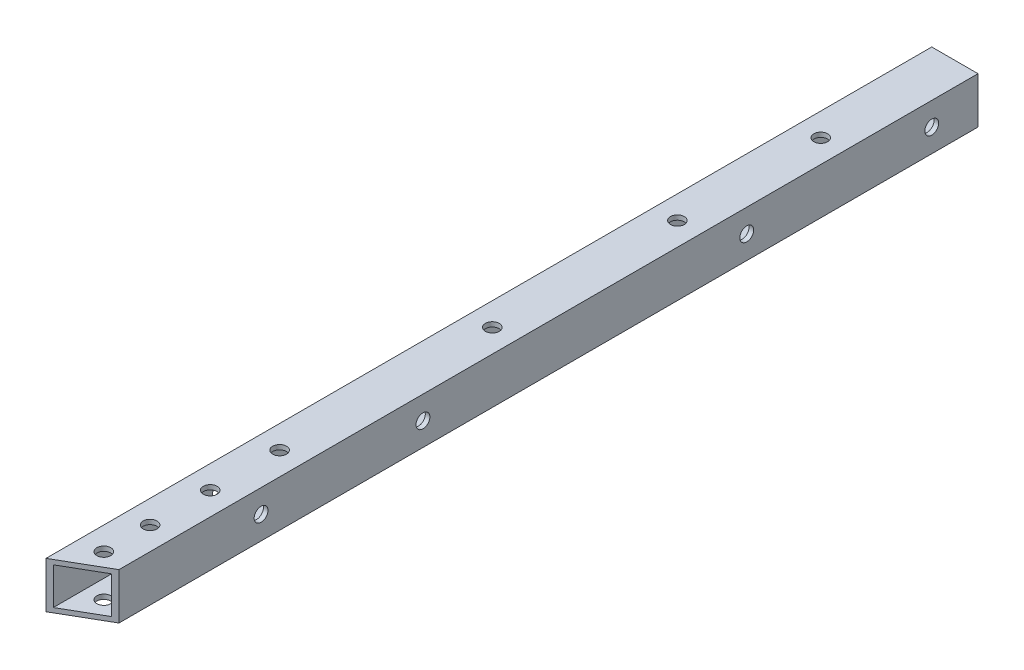
ISO-10303-21;
HEADER;
FILE_DESCRIPTION(('STEP AP214'),'2;1');
FILE_NAME('part.step','',(''),(''),'','','');
FILE_SCHEMA(('AUTOMOTIVE_DESIGN { 1 0 10303 214 1 1 1 1 }'));
ENDSEC;
DATA;
#1=APPLICATION_CONTEXT('core data for automotive mechanical design processes');
#2=APPLICATION_PROTOCOL_DEFINITION('international standard','automotive_design',2000,#1);
#3=PRODUCT_CONTEXT('',#1,'mechanical');
#4=PRODUCT('Part','Part','',(#3));
#5=PRODUCT_RELATED_PRODUCT_CATEGORY('part','',(#4));
#6=PRODUCT_DEFINITION_FORMATION('','',#4);
#7=PRODUCT_DEFINITION_CONTEXT('part definition',#1,'design');
#8=PRODUCT_DEFINITION('design','',#6,#7);
#9=PRODUCT_DEFINITION_SHAPE('','',#8);
#10=(LENGTH_UNIT() NAMED_UNIT(*) SI_UNIT(.MILLI.,.METRE.));
#11=(NAMED_UNIT(*) PLANE_ANGLE_UNIT() SI_UNIT($,.RADIAN.));
#12=(NAMED_UNIT(*) SI_UNIT($,.STERADIAN.) SOLID_ANGLE_UNIT());
#13=UNCERTAINTY_MEASURE_WITH_UNIT(LENGTH_MEASURE(1.E-05),#10,'distance_accuracy_value','');
#14=(GEOMETRIC_REPRESENTATION_CONTEXT(3) GLOBAL_UNCERTAINTY_ASSIGNED_CONTEXT((#13)) GLOBAL_UNIT_ASSIGNED_CONTEXT((#10,
#11,#12)) REPRESENTATION_CONTEXT('',''));
#15=CARTESIAN_POINT('',(0.,0.,0.));
#16=DIRECTION('',(0.,0.,1.));
#17=DIRECTION('',(1.,0.,0.));
#18=AXIS2_PLACEMENT_3D('',#15,#16,#17);
#19=CARTESIAN_POINT('',(0.,0.,0.));
#20=DIRECTION('',(0.,0.,1.));
#21=DIRECTION('',(1.,0.,0.));
#22=AXIS2_PLACEMENT_3D('',#19,#20,#21);
#23=PLANE('',#22);
#24=DIRECTION('',(0.,-1.,0.));
#25=VECTOR('',#24,1.);
#26=CARTESIAN_POINT('',(-5.,-5.,0.));
#27=LINE('',#26,#25);
#28=CARTESIAN_POINT('',(-5.,5.,0.));
#29=VERTEX_POINT('',#28);
#30=CARTESIAN_POINT('',(-5.,-5.,0.));
#31=VERTEX_POINT('',#30);
#32=EDGE_CURVE('E289',#29,#31,#27,.T.);
#33=ORIENTED_EDGE('',*,*,#32,.F.);
#34=DIRECTION('',(-1.,0.,0.));
#35=VECTOR('',#34,1.);
#36=CARTESIAN_POINT('',(-5.,5.,0.));
#37=LINE('',#36,#35);
#38=CARTESIAN_POINT('',(4.99999999999999,5.,0.));
#39=VERTEX_POINT('',#38);
#40=EDGE_CURVE('E291',#39,#29,#37,.T.);
#41=ORIENTED_EDGE('',*,*,#40,.F.);
#42=DIRECTION('',(0.,1.,0.));
#43=VECTOR('',#42,1.);
#44=CARTESIAN_POINT('',(4.99999999999999,-5.,0.));
#45=LINE('',#44,#43);
#46=CARTESIAN_POINT('',(4.99999999999999,-5.,0.));
#47=VERTEX_POINT('',#46);
#48=EDGE_CURVE('E295',#47,#39,#45,.T.);
#49=ORIENTED_EDGE('',*,*,#48,.F.);
#50=DIRECTION('',(1.,0.,0.));
#51=VECTOR('',#50,1.);
#52=CARTESIAN_POINT('',(-5.,-5.,0.));
#53=LINE('',#52,#51);
#54=EDGE_CURVE('E148',#31,#47,#53,.T.);
#55=ORIENTED_EDGE('',*,*,#54,.F.);
#56=EDGE_LOOP('',(#33,#41,#49,#55));
#57=FACE_BOUND('',#56,.T.);
#58=DIRECTION('',(0.,-1.,0.));
#59=VECTOR('',#58,1.);
#60=CARTESIAN_POINT('',(-4.,0.,0.));
#61=LINE('',#60,#59);
#62=CARTESIAN_POINT('',(-4.,4.,0.));
#63=VERTEX_POINT('',#62);
#64=CARTESIAN_POINT('',(-4.,-4.,0.));
#65=VERTEX_POINT('',#64);
#66=EDGE_CURVE('E269',#63,#65,#61,.T.);
#67=ORIENTED_EDGE('',*,*,#66,.T.);
#68=DIRECTION('',(1.,0.,0.));
#69=VECTOR('',#68,1.);
#70=CARTESIAN_POINT('',(0.,-4.,0.));
#71=LINE('',#70,#69);
#72=CARTESIAN_POINT('',(3.99999999999999,-4.,0.));
#73=VERTEX_POINT('',#72);
#74=EDGE_CURVE('E272',#65,#73,#71,.T.);
#75=ORIENTED_EDGE('',*,*,#74,.T.);
#76=DIRECTION('',(0.,1.,0.));
#77=VECTOR('',#76,1.);
#78=CARTESIAN_POINT('',(3.99999999999999,0.,0.));
#79=LINE('',#78,#77);
#80=CARTESIAN_POINT('',(3.99999999999999,4.,0.));
#81=VERTEX_POINT('',#80);
#82=EDGE_CURVE('E275',#73,#81,#79,.T.);
#83=ORIENTED_EDGE('',*,*,#82,.T.);
#84=DIRECTION('',(-1.,0.,0.));
#85=VECTOR('',#84,1.);
#86=CARTESIAN_POINT('',(0.,4.,0.));
#87=LINE('',#86,#85);
#88=EDGE_CURVE('E278',#81,#63,#87,.T.);
#89=ORIENTED_EDGE('',*,*,#88,.T.);
#90=EDGE_LOOP('',(#67,#75,#83,#89));
#91=FACE_BOUND('',#90,.T.);
#92=ADVANCED_FACE('F63',(#57,#91),#23,.F.);
#93=CARTESIAN_POINT('',(-5.,-5.,191.5));
#94=DIRECTION('',(1.,0.,0.));
#95=DIRECTION('',(0.,0.,-1.));
#96=AXIS2_PLACEMENT_3D('',#93,#94,#95);
#97=PLANE('',#96);
#98=CARTESIAN_POINT('',(-5.,0.,155.));
#99=DIRECTION('',(-1.,0.,0.));
#100=DIRECTION('',(0.,0.,1.));
#101=AXIS2_PLACEMENT_3D('',#98,#99,#100);
#102=CIRCLE('',#101,1.5);
#103=CARTESIAN_POINT('',(-5.,0.,156.5));
#104=VERTEX_POINT('',#103);
#105=EDGE_CURVE('E409',#104,#104,#102,.T.);
#106=ORIENTED_EDGE('',*,*,#105,.F.);
#107=EDGE_LOOP('',(#106));
#108=FACE_BOUND('',#107,.T.);
#109=CARTESIAN_POINT('',(-5.,0.,50.));
#110=DIRECTION('',(-1.,0.,0.));
#111=DIRECTION('',(0.,0.,1.));
#112=AXIS2_PLACEMENT_3D('',#109,#110,#111);
#113=CIRCLE('',#112,1.5);
#114=CARTESIAN_POINT('',(-5.,0.,51.5));
#115=VERTEX_POINT('',#114);
#116=EDGE_CURVE('E410',#115,#115,#113,.T.);
#117=ORIENTED_EDGE('',*,*,#116,.F.);
#118=EDGE_LOOP('',(#117));
#119=FACE_BOUND('',#118,.T.);
#120=CARTESIAN_POINT('',(-5.,0.,120.));
#121=DIRECTION('',(-1.,0.,0.));
#122=DIRECTION('',(0.,0.,1.));
#123=AXIS2_PLACEMENT_3D('',#120,#121,#122);
#124=CIRCLE('',#123,1.5);
#125=CARTESIAN_POINT('',(-5.,0.,121.5));
#126=VERTEX_POINT('',#125);
#127=EDGE_CURVE('E420',#126,#126,#124,.T.);
#128=ORIENTED_EDGE('',*,*,#127,.F.);
#129=EDGE_LOOP('',(#128));
#130=FACE_BOUND('',#129,.T.);
#131=CARTESIAN_POINT('',(-5.,0.,10.));
#132=DIRECTION('',(-1.,0.,0.));
#133=DIRECTION('',(0.,0.,1.));
#134=AXIS2_PLACEMENT_3D('',#131,#132,#133);
#135=CIRCLE('',#134,1.5);
#136=CARTESIAN_POINT('',(-5.,0.,11.5));
#137=VERTEX_POINT('',#136);
#138=EDGE_CURVE('E426',#137,#137,#135,.T.);
#139=ORIENTED_EDGE('',*,*,#138,.F.);
#140=EDGE_LOOP('',(#139));
#141=FACE_BOUND('',#140,.T.);
#142=ORIENTED_EDGE('',*,*,#32,.T.);
#143=DIRECTION('',(0.,0.,-1.));
#144=VECTOR('',#143,1.);
#145=CARTESIAN_POINT('',(-5.,-5.,191.5));
#146=LINE('',#145,#144);
#147=CARTESIAN_POINT('',(-5.,-5.,191.5));
#148=VERTEX_POINT('',#147);
#149=EDGE_CURVE('E72',#148,#31,#146,.T.);
#150=ORIENTED_EDGE('',*,*,#149,.F.);
#151=DIRECTION('',(0.,-1.,0.));
#152=VECTOR('',#151,1.);
#153=CARTESIAN_POINT('',(-5.,-5.,191.5));
#154=LINE('',#153,#152);
#155=CARTESIAN_POINT('',(-5.,5.,191.5));
#156=VERTEX_POINT('',#155);
#157=EDGE_CURVE('E130',#156,#148,#154,.T.);
#158=ORIENTED_EDGE('',*,*,#157,.F.);
#159=DIRECTION('',(0.,0.,-1.));
#160=VECTOR('',#159,1.);
#161=CARTESIAN_POINT('',(-5.,5.,191.5));
#162=LINE('',#161,#160);
#163=EDGE_CURVE('E152',#156,#29,#162,.T.);
#164=ORIENTED_EDGE('',*,*,#163,.T.);
#165=EDGE_LOOP('',(#142,#150,#158,#164));
#166=FACE_BOUND('',#165,.T.);
#167=ADVANCED_FACE('F65',(#108,#119,#130,#141,#166),#97,.F.);
#168=CARTESIAN_POINT('',(-5.,-5.,191.5));
#169=DIRECTION('',(0.,1.,0.));
#170=DIRECTION('',(0.,0.,1.));
#171=AXIS2_PLACEMENT_3D('',#168,#169,#170);
#172=PLANE('',#171);
#173=CARTESIAN_POINT('',(0.,-5.,60.));
#174=DIRECTION('',(0.,-1.,0.));
#175=DIRECTION('',(0.,0.,-1.));
#176=AXIS2_PLACEMENT_3D('',#173,#174,#175);
#177=CIRCLE('',#176,1.5);
#178=CARTESIAN_POINT('',(0.,-5.,58.5));
#179=VERTEX_POINT('',#178);
#180=EDGE_CURVE('E234',#179,#179,#177,.T.);
#181=ORIENTED_EDGE('',*,*,#180,.F.);
#182=EDGE_LOOP('',(#181));
#183=FACE_BOUND('',#182,.T.);
#184=CARTESIAN_POINT('',(0.,-5.,100.));
#185=DIRECTION('',(0.,-1.,0.));
#186=DIRECTION('',(0.,0.,-1.));
#187=AXIS2_PLACEMENT_3D('',#184,#185,#186);
#188=CIRCLE('',#187,1.5);
#189=CARTESIAN_POINT('',(0.,-5.,98.5));
#190=VERTEX_POINT('',#189);
#191=EDGE_CURVE('E145',#190,#190,#188,.T.);
#192=ORIENTED_EDGE('',*,*,#191,.F.);
#193=EDGE_LOOP('',(#192));
#194=FACE_BOUND('',#193,.T.);
#195=CARTESIAN_POINT('',(0.,-5.,29.));
#196=DIRECTION('',(0.,-1.,0.));
#197=DIRECTION('',(0.,0.,-1.));
#198=AXIS2_PLACEMENT_3D('',#195,#196,#197);
#199=CIRCLE('',#198,1.5);
#200=CARTESIAN_POINT('',(0.,-5.,27.5));
#201=VERTEX_POINT('',#200);
#202=EDGE_CURVE('E239',#201,#201,#199,.T.);
#203=ORIENTED_EDGE('',*,*,#202,.F.);
#204=EDGE_LOOP('',(#203));
#205=FACE_BOUND('',#204,.T.);
#206=CARTESIAN_POINT('',(0.,-5.,161.));
#207=DIRECTION('',(0.,-1.,0.));
#208=DIRECTION('',(0.,0.,-1.));
#209=AXIS2_PLACEMENT_3D('',#206,#207,#208);
#210=CIRCLE('',#209,1.5);
#211=CARTESIAN_POINT('',(0.,-5.,159.5));
#212=VERTEX_POINT('',#211);
#213=EDGE_CURVE('E211',#212,#212,#210,.T.);
#214=ORIENTED_EDGE('',*,*,#213,.F.);
#215=EDGE_LOOP('',(#214));
#216=FACE_BOUND('',#215,.T.);
#217=CARTESIAN_POINT('',(0.,-5.,146.));
#218=DIRECTION('',(0.,-1.,0.));
#219=DIRECTION('',(0.,0.,-1.));
#220=AXIS2_PLACEMENT_3D('',#217,#218,#219);
#221=CIRCLE('',#220,1.5);
#222=CARTESIAN_POINT('',(0.,-5.,144.5));
#223=VERTEX_POINT('',#222);
#224=EDGE_CURVE('E224',#223,#223,#221,.T.);
#225=ORIENTED_EDGE('',*,*,#224,.F.);
#226=EDGE_LOOP('',(#225));
#227=FACE_BOUND('',#226,.T.);
#228=CARTESIAN_POINT('',(0.,-5.,173.994446500535));
#229=DIRECTION('',(0.,-1.,0.));
#230=DIRECTION('',(0.,0.,-1.));
#231=AXIS2_PLACEMENT_3D('',#228,#229,#230);
#232=CIRCLE('',#231,1.5);
#233=CARTESIAN_POINT('',(0.,-5.,172.494446500535));
#234=VERTEX_POINT('',#233);
#235=EDGE_CURVE('E217',#234,#234,#232,.T.);
#236=ORIENTED_EDGE('',*,*,#235,.F.);
#237=EDGE_LOOP('',(#236));
#238=FACE_BOUND('',#237,.T.);
#239=CARTESIAN_POINT('',(0.,-5.,183.994446500535));
#240=DIRECTION('',(0.,-1.,0.));
#241=DIRECTION('',(0.,0.,-1.));
#242=AXIS2_PLACEMENT_3D('',#239,#240,#241);
#243=CIRCLE('',#242,1.5);
#244=CARTESIAN_POINT('',(0.,-5.,182.494446500535));
#245=VERTEX_POINT('',#244);
#246=EDGE_CURVE('E242',#245,#245,#243,.T.);
#247=ORIENTED_EDGE('',*,*,#246,.F.);
#248=EDGE_LOOP('',(#247));
#249=FACE_BOUND('',#248,.T.);
#250=DIRECTION('',(0.,0.,-1.));
#251=VECTOR('',#250,1.);
#252=CARTESIAN_POINT('',(4.99999999999999,-5.,191.5));
#253=LINE('',#252,#251);
#254=CARTESIAN_POINT('',(4.99999999999999,-5.,185.726497308104));
#255=VERTEX_POINT('',#254);
#256=EDGE_CURVE('E142',#255,#47,#253,.T.);
#257=ORIENTED_EDGE('',*,*,#256,.F.);
#258=DIRECTION('',(0.866025403784442,0.,-0.499999999999994));
#259=VECTOR('',#258,1.);
#260=CARTESIAN_POINT('',(-5.,-5.,191.5));
#261=LINE('',#260,#259);
#262=EDGE_CURVE('E127',#148,#255,#261,.T.);
#263=ORIENTED_EDGE('',*,*,#262,.F.);
#264=ORIENTED_EDGE('',*,*,#149,.T.);
#265=ORIENTED_EDGE('',*,*,#54,.T.);
#266=EDGE_LOOP('',(#257,#263,#264,#265));
#267=FACE_BOUND('',#266,.T.);
#268=ADVANCED_FACE('F147',(#183,#194,#205,#216,#227,#238,#249,#267),#172,.F.);
#269=CARTESIAN_POINT('',(4.99999999999999,-5.,191.5));
#270=DIRECTION('',(-1.,0.,0.));
#271=DIRECTION('',(0.,0.,1.));
#272=AXIS2_PLACEMENT_3D('',#269,#270,#271);
#273=PLANE('',#272);
#274=CARTESIAN_POINT('',(4.99999999999999,0.,155.));
#275=DIRECTION('',(-1.,0.,0.));
#276=DIRECTION('',(0.,0.,1.));
#277=AXIS2_PLACEMENT_3D('',#274,#275,#276);
#278=CIRCLE('',#277,1.5);
#279=CARTESIAN_POINT('',(4.99999999999999,0.,156.5));
#280=VERTEX_POINT('',#279);
#281=EDGE_CURVE('E189',#280,#280,#278,.T.);
#282=ORIENTED_EDGE('',*,*,#281,.T.);
#283=EDGE_LOOP('',(#282));
#284=FACE_BOUND('',#283,.T.);
#285=CARTESIAN_POINT('',(4.99999999999999,0.,50.));
#286=DIRECTION('',(-1.,0.,0.));
#287=DIRECTION('',(0.,0.,1.));
#288=AXIS2_PLACEMENT_3D('',#285,#286,#287);
#289=CIRCLE('',#288,1.5);
#290=CARTESIAN_POINT('',(4.99999999999999,0.,51.5));
#291=VERTEX_POINT('',#290);
#292=EDGE_CURVE('E415',#291,#291,#289,.T.);
#293=ORIENTED_EDGE('',*,*,#292,.T.);
#294=EDGE_LOOP('',(#293));
#295=FACE_BOUND('',#294,.T.);
#296=CARTESIAN_POINT('',(4.99999999999999,0.,120.));
#297=DIRECTION('',(-1.,0.,0.));
#298=DIRECTION('',(0.,0.,1.));
#299=AXIS2_PLACEMENT_3D('',#296,#297,#298);
#300=CIRCLE('',#299,1.5);
#301=CARTESIAN_POINT('',(4.99999999999999,0.,121.5));
#302=VERTEX_POINT('',#301);
#303=EDGE_CURVE('E423',#302,#302,#300,.T.);
#304=ORIENTED_EDGE('',*,*,#303,.T.);
#305=EDGE_LOOP('',(#304));
#306=FACE_BOUND('',#305,.T.);
#307=CARTESIAN_POINT('',(4.99999999999999,0.,10.));
#308=DIRECTION('',(-1.,0.,0.));
#309=DIRECTION('',(0.,0.,1.));
#310=AXIS2_PLACEMENT_3D('',#307,#308,#309);
#311=CIRCLE('',#310,1.5);
#312=CARTESIAN_POINT('',(4.99999999999999,0.,11.5));
#313=VERTEX_POINT('',#312);
#314=EDGE_CURVE('E428',#313,#313,#311,.T.);
#315=ORIENTED_EDGE('',*,*,#314,.T.);
#316=EDGE_LOOP('',(#315));
#317=FACE_BOUND('',#316,.T.);
#318=DIRECTION('',(0.,0.,-1.));
#319=VECTOR('',#318,1.);
#320=CARTESIAN_POINT('',(4.99999999999999,5.,191.5));
#321=LINE('',#320,#319);
#322=CARTESIAN_POINT('',(4.99999999999999,5.,185.726497308104));
#323=VERTEX_POINT('',#322);
#324=EDGE_CURVE('E144',#323,#39,#321,.T.);
#325=ORIENTED_EDGE('',*,*,#324,.F.);
#326=DIRECTION('',(0.,-1.,0.));
#327=VECTOR('',#326,1.);
#328=CARTESIAN_POINT('',(4.99999999999999,5.,185.726497308104));
#329=LINE('',#328,#327);
#330=EDGE_CURVE('E80',#323,#255,#329,.T.);
#331=ORIENTED_EDGE('',*,*,#330,.T.);
#332=ORIENTED_EDGE('',*,*,#256,.T.);
#333=ORIENTED_EDGE('',*,*,#48,.T.);
#334=EDGE_LOOP('',(#325,#331,#332,#333));
#335=FACE_BOUND('',#334,.T.);
#336=ADVANCED_FACE('F140',(#284,#295,#306,#317,#335),#273,.F.);
#337=CARTESIAN_POINT('',(-5.,5.,191.5));
#338=DIRECTION('',(0.,-1.,0.));
#339=DIRECTION('',(0.,0.,-1.));
#340=AXIS2_PLACEMENT_3D('',#337,#338,#339);
#341=PLANE('',#340);
#342=CARTESIAN_POINT('',(0.,5.,60.));
#343=DIRECTION('',(0.,-1.,0.));
#344=DIRECTION('',(0.,0.,-1.));
#345=AXIS2_PLACEMENT_3D('',#342,#343,#344);
#346=CIRCLE('',#345,1.5);
#347=CARTESIAN_POINT('',(0.,5.,58.5));
#348=VERTEX_POINT('',#347);
#349=EDGE_CURVE('E220',#348,#348,#346,.T.);
#350=ORIENTED_EDGE('',*,*,#349,.T.);
#351=EDGE_LOOP('',(#350));
#352=FACE_BOUND('',#351,.T.);
#353=CARTESIAN_POINT('',(0.,5.,100.));
#354=DIRECTION('',(0.,-1.,0.));
#355=DIRECTION('',(0.,0.,-1.));
#356=AXIS2_PLACEMENT_3D('',#353,#354,#355);
#357=CIRCLE('',#356,1.5);
#358=CARTESIAN_POINT('',(0.,5.,98.5));
#359=VERTEX_POINT('',#358);
#360=EDGE_CURVE('E231',#359,#359,#357,.T.);
#361=ORIENTED_EDGE('',*,*,#360,.T.);
#362=EDGE_LOOP('',(#361));
#363=FACE_BOUND('',#362,.T.);
#364=CARTESIAN_POINT('',(0.,5.,29.));
#365=DIRECTION('',(0.,-1.,0.));
#366=DIRECTION('',(0.,0.,-1.));
#367=AXIS2_PLACEMENT_3D('',#364,#365,#366);
#368=CIRCLE('',#367,1.5);
#369=CARTESIAN_POINT('',(0.,5.,27.5));
#370=VERTEX_POINT('',#369);
#371=EDGE_CURVE('E135',#370,#370,#368,.T.);
#372=ORIENTED_EDGE('',*,*,#371,.T.);
#373=EDGE_LOOP('',(#372));
#374=FACE_BOUND('',#373,.T.);
#375=CARTESIAN_POINT('',(0.,5.,161.));
#376=DIRECTION('',(0.,-1.,0.));
#377=DIRECTION('',(0.,0.,-1.));
#378=AXIS2_PLACEMENT_3D('',#375,#376,#377);
#379=CIRCLE('',#378,1.5);
#380=CARTESIAN_POINT('',(0.,5.,159.5));
#381=VERTEX_POINT('',#380);
#382=EDGE_CURVE('E210',#381,#381,#379,.T.);
#383=ORIENTED_EDGE('',*,*,#382,.T.);
#384=EDGE_LOOP('',(#383));
#385=FACE_BOUND('',#384,.T.);
#386=CARTESIAN_POINT('',(0.,5.,146.));
#387=DIRECTION('',(0.,-1.,0.));
#388=DIRECTION('',(0.,0.,-1.));
#389=AXIS2_PLACEMENT_3D('',#386,#387,#388);
#390=CIRCLE('',#389,1.5);
#391=CARTESIAN_POINT('',(0.,5.,144.5));
#392=VERTEX_POINT('',#391);
#393=EDGE_CURVE('E214',#392,#392,#390,.T.);
#394=ORIENTED_EDGE('',*,*,#393,.T.);
#395=EDGE_LOOP('',(#394));
#396=FACE_BOUND('',#395,.T.);
#397=CARTESIAN_POINT('',(0.,5.,173.994446500535));
#398=DIRECTION('',(0.,-1.,0.));
#399=DIRECTION('',(0.,0.,-1.));
#400=AXIS2_PLACEMENT_3D('',#397,#398,#399);
#401=CIRCLE('',#400,1.5);
#402=CARTESIAN_POINT('',(0.,5.,172.494446500535));
#403=VERTEX_POINT('',#402);
#404=EDGE_CURVE('E221',#403,#403,#401,.T.);
#405=ORIENTED_EDGE('',*,*,#404,.T.);
#406=EDGE_LOOP('',(#405));
#407=FACE_BOUND('',#406,.T.);
#408=CARTESIAN_POINT('',(0.,5.,183.994446500535));
#409=DIRECTION('',(0.,-1.,0.));
#410=DIRECTION('',(0.,0.,-1.));
#411=AXIS2_PLACEMENT_3D('',#408,#409,#410);
#412=CIRCLE('',#411,1.5);
#413=CARTESIAN_POINT('',(0.,5.,182.494446500535));
#414=VERTEX_POINT('',#413);
#415=EDGE_CURVE('E160',#414,#414,#412,.T.);
#416=ORIENTED_EDGE('',*,*,#415,.T.);
#417=EDGE_LOOP('',(#416));
#418=FACE_BOUND('',#417,.T.);
#419=ORIENTED_EDGE('',*,*,#163,.F.);
#420=DIRECTION('',(0.866025403784442,0.,-0.499999999999994));
#421=VECTOR('',#420,1.);
#422=CARTESIAN_POINT('',(-5.,5.,191.5));
#423=LINE('',#422,#421);
#424=EDGE_CURVE('E136',#156,#323,#423,.T.);
#425=ORIENTED_EDGE('',*,*,#424,.T.);
#426=ORIENTED_EDGE('',*,*,#324,.T.);
#427=ORIENTED_EDGE('',*,*,#40,.T.);
#428=EDGE_LOOP('',(#419,#425,#426,#427));
#429=FACE_BOUND('',#428,.T.);
#430=ADVANCED_FACE('F305',(#352,#363,#374,#385,#396,#407,#418,#429),#341,.F.);
#431=CARTESIAN_POINT('',(-4.,0.,191.5));
#432=DIRECTION('',(1.,0.,0.));
#433=DIRECTION('',(0.,0.,-1.));
#434=AXIS2_PLACEMENT_3D('',#431,#432,#433);
#435=PLANE('',#434);
#436=CARTESIAN_POINT('',(-4.,0.,155.));
#437=DIRECTION('',(1.,0.,0.));
#438=DIRECTION('',(0.,0.,-1.));
#439=AXIS2_PLACEMENT_3D('',#436,#437,#438);
#440=CIRCLE('',#439,1.5);
#441=CARTESIAN_POINT('',(-4.,0.,153.5));
#442=VERTEX_POINT('',#441);
#443=EDGE_CURVE('E207',#442,#442,#440,.T.);
#444=ORIENTED_EDGE('',*,*,#443,.F.);
#445=EDGE_LOOP('',(#444));
#446=FACE_BOUND('',#445,.T.);
#447=CARTESIAN_POINT('',(-4.,0.,50.));
#448=DIRECTION('',(1.,0.,0.));
#449=DIRECTION('',(0.,0.,-1.));
#450=AXIS2_PLACEMENT_3D('',#447,#448,#449);
#451=CIRCLE('',#450,1.5);
#452=CARTESIAN_POINT('',(-4.,0.,48.5));
#453=VERTEX_POINT('',#452);
#454=EDGE_CURVE('E195',#453,#453,#451,.T.);
#455=ORIENTED_EDGE('',*,*,#454,.F.);
#456=EDGE_LOOP('',(#455));
#457=FACE_BOUND('',#456,.T.);
#458=CARTESIAN_POINT('',(-4.,0.,120.));
#459=DIRECTION('',(1.,0.,0.));
#460=DIRECTION('',(0.,0.,-1.));
#461=AXIS2_PLACEMENT_3D('',#458,#459,#460);
#462=CIRCLE('',#461,1.5);
#463=CARTESIAN_POINT('',(-4.,0.,118.5));
#464=VERTEX_POINT('',#463);
#465=EDGE_CURVE('E192',#464,#464,#462,.T.);
#466=ORIENTED_EDGE('',*,*,#465,.F.);
#467=EDGE_LOOP('',(#466));
#468=FACE_BOUND('',#467,.T.);
#469=CARTESIAN_POINT('',(-4.,0.,10.));
#470=DIRECTION('',(1.,0.,0.));
#471=DIRECTION('',(0.,0.,-1.));
#472=AXIS2_PLACEMENT_3D('',#469,#470,#471);
#473=CIRCLE('',#472,1.5);
#474=CARTESIAN_POINT('',(-4.,0.,8.5));
#475=VERTEX_POINT('',#474);
#476=EDGE_CURVE('E188',#475,#475,#473,.T.);
#477=ORIENTED_EDGE('',*,*,#476,.F.);
#478=EDGE_LOOP('',(#477));
#479=FACE_BOUND('',#478,.T.);
#480=DIRECTION('',(0.,1.,0.));
#481=VECTOR('',#480,1.);
#482=CARTESIAN_POINT('',(-4.,0.,190.92264973081));
#483=LINE('',#482,#481);
#484=CARTESIAN_POINT('',(-4.,-4.,190.92264973081));
#485=VERTEX_POINT('',#484);
#486=CARTESIAN_POINT('',(-4.,4.,190.92264973081));
#487=VERTEX_POINT('',#486);
#488=EDGE_CURVE('E87',#485,#487,#483,.T.);
#489=ORIENTED_EDGE('',*,*,#488,.F.);
#490=DIRECTION('',(0.,0.,-1.));
#491=VECTOR('',#490,1.);
#492=CARTESIAN_POINT('',(-4.,-4.,191.5));
#493=LINE('',#492,#491);
#494=EDGE_CURVE('E287',#485,#65,#493,.T.);
#495=ORIENTED_EDGE('',*,*,#494,.T.);
#496=ORIENTED_EDGE('',*,*,#66,.F.);
#497=DIRECTION('',(0.,0.,-1.));
#498=VECTOR('',#497,1.);
#499=CARTESIAN_POINT('',(-4.,4.,191.5));
#500=LINE('',#499,#498);
#501=EDGE_CURVE('E281',#487,#63,#500,.T.);
#502=ORIENTED_EDGE('',*,*,#501,.F.);
#503=EDGE_LOOP('',(#489,#495,#496,#502));
#504=FACE_BOUND('',#503,.T.);
#505=ADVANCED_FACE('F307',(#446,#457,#468,#479,#504),#435,.T.);
#506=CARTESIAN_POINT('',(0.,-4.,191.5));
#507=DIRECTION('',(0.,1.,0.));
#508=DIRECTION('',(0.,0.,1.));
#509=AXIS2_PLACEMENT_3D('',#506,#507,#508);
#510=PLANE('',#509);
#511=CARTESIAN_POINT('',(0.,-4.,60.));
#512=DIRECTION('',(0.,1.,0.));
#513=DIRECTION('',(0.,0.,1.));
#514=AXIS2_PLACEMENT_3D('',#511,#512,#513);
#515=CIRCLE('',#514,1.5);
#516=CARTESIAN_POINT('',(0.,-4.,61.5));
#517=VERTEX_POINT('',#516);
#518=EDGE_CURVE('E184',#517,#517,#515,.T.);
#519=ORIENTED_EDGE('',*,*,#518,.F.);
#520=EDGE_LOOP('',(#519));
#521=FACE_BOUND('',#520,.T.);
#522=CARTESIAN_POINT('',(0.,-4.,100.));
#523=DIRECTION('',(0.,1.,0.));
#524=DIRECTION('',(0.,0.,1.));
#525=AXIS2_PLACEMENT_3D('',#522,#523,#524);
#526=CIRCLE('',#525,1.5);
#527=CARTESIAN_POINT('',(0.,-4.,101.5));
#528=VERTEX_POINT('',#527);
#529=EDGE_CURVE('E180',#528,#528,#526,.T.);
#530=ORIENTED_EDGE('',*,*,#529,.F.);
#531=EDGE_LOOP('',(#530));
#532=FACE_BOUND('',#531,.T.);
#533=DIRECTION('',(-0.866025403784442,0.,0.499999999999994));
#534=VECTOR('',#533,1.);
#535=CARTESIAN_POINT('',(-1.24999999999997,-4.,189.334936490539));
#536=LINE('',#535,#534);
#537=CARTESIAN_POINT('',(3.99999999999999,-4.,186.303847577293));
#538=VERTEX_POINT('',#537);
#539=EDGE_CURVE('E262',#538,#485,#536,.T.);
#540=ORIENTED_EDGE('',*,*,#539,.F.);
#541=DIRECTION('',(0.,0.,-1.));
#542=VECTOR('',#541,1.);
#543=CARTESIAN_POINT('',(3.99999999999999,-4.,191.5));
#544=LINE('',#543,#542);
#545=EDGE_CURVE('E285',#538,#73,#544,.T.);
#546=ORIENTED_EDGE('',*,*,#545,.T.);
#547=ORIENTED_EDGE('',*,*,#74,.F.);
#548=ORIENTED_EDGE('',*,*,#494,.F.);
#549=EDGE_LOOP('',(#540,#546,#547,#548));
#550=FACE_BOUND('',#549,.T.);
#551=CARTESIAN_POINT('',(0.,-4.,29.));
#552=DIRECTION('',(0.,1.,0.));
#553=DIRECTION('',(0.,0.,1.));
#554=AXIS2_PLACEMENT_3D('',#551,#552,#553);
#555=CIRCLE('',#554,1.5);
#556=CARTESIAN_POINT('',(0.,-4.,30.5));
#557=VERTEX_POINT('',#556);
#558=EDGE_CURVE('E175',#557,#557,#555,.T.);
#559=ORIENTED_EDGE('',*,*,#558,.F.);
#560=EDGE_LOOP('',(#559));
#561=FACE_BOUND('',#560,.T.);
#562=CARTESIAN_POINT('',(0.,-4.,161.));
#563=DIRECTION('',(0.,1.,0.));
#564=DIRECTION('',(0.,0.,1.));
#565=AXIS2_PLACEMENT_3D('',#562,#563,#564);
#566=CIRCLE('',#565,1.5);
#567=CARTESIAN_POINT('',(0.,-4.,162.5));
#568=VERTEX_POINT('',#567);
#569=EDGE_CURVE('E172',#568,#568,#566,.T.);
#570=ORIENTED_EDGE('',*,*,#569,.F.);
#571=EDGE_LOOP('',(#570));
#572=FACE_BOUND('',#571,.T.);
#573=CARTESIAN_POINT('',(0.,-4.,146.));
#574=DIRECTION('',(0.,1.,0.));
#575=DIRECTION('',(0.,0.,1.));
#576=AXIS2_PLACEMENT_3D('',#573,#574,#575);
#577=CIRCLE('',#576,1.5);
#578=CARTESIAN_POINT('',(0.,-4.,147.5));
#579=VERTEX_POINT('',#578);
#580=EDGE_CURVE('E168',#579,#579,#577,.T.);
#581=ORIENTED_EDGE('',*,*,#580,.F.);
#582=EDGE_LOOP('',(#581));
#583=FACE_BOUND('',#582,.T.);
#584=CARTESIAN_POINT('',(0.,-4.,173.994446500535));
#585=DIRECTION('',(0.,1.,0.));
#586=DIRECTION('',(0.,0.,1.));
#587=AXIS2_PLACEMENT_3D('',#584,#585,#586);
#588=CIRCLE('',#587,1.5);
#589=CARTESIAN_POINT('',(0.,-4.,175.494446500535));
#590=VERTEX_POINT('',#589);
#591=EDGE_CURVE('E164',#590,#590,#588,.T.);
#592=ORIENTED_EDGE('',*,*,#591,.F.);
#593=EDGE_LOOP('',(#592));
#594=FACE_BOUND('',#593,.T.);
#595=CARTESIAN_POINT('',(0.,-4.,183.994446500535));
#596=DIRECTION('',(0.,1.,0.));
#597=DIRECTION('',(0.,0.,1.));
#598=AXIS2_PLACEMENT_3D('',#595,#596,#597);
#599=CIRCLE('',#598,1.5);
#600=CARTESIAN_POINT('',(0.,-4.,185.494446500535));
#601=VERTEX_POINT('',#600);
#602=EDGE_CURVE('E159',#601,#601,#599,.T.);
#603=ORIENTED_EDGE('',*,*,#602,.F.);
#604=EDGE_LOOP('',(#603));
#605=FACE_BOUND('',#604,.T.);
#606=ADVANCED_FACE('F314',(#521,#532,#550,#561,#572,#583,#594,#605),#510,.T.);
#607=CARTESIAN_POINT('',(3.99999999999999,0.,191.5));
#608=DIRECTION('',(-1.,0.,0.));
#609=DIRECTION('',(0.,0.,1.));
#610=AXIS2_PLACEMENT_3D('',#607,#608,#609);
#611=PLANE('',#610);
#612=CARTESIAN_POINT('',(3.99999999999999,0.,155.));
#613=DIRECTION('',(-1.,0.,0.));
#614=DIRECTION('',(0.,0.,1.));
#615=AXIS2_PLACEMENT_3D('',#612,#613,#614);
#616=CIRCLE('',#615,1.5);
#617=CARTESIAN_POINT('',(3.99999999999999,0.,156.5));
#618=VERTEX_POINT('',#617);
#619=EDGE_CURVE('E67',#618,#618,#616,.T.);
#620=ORIENTED_EDGE('',*,*,#619,.F.);
#621=EDGE_LOOP('',(#620));
#622=FACE_BOUND('',#621,.T.);
#623=CARTESIAN_POINT('',(3.99999999999999,0.,50.));
#624=DIRECTION('',(-1.,0.,0.));
#625=DIRECTION('',(0.,0.,1.));
#626=AXIS2_PLACEMENT_3D('',#623,#624,#625);
#627=CIRCLE('',#626,1.5);
#628=CARTESIAN_POINT('',(3.99999999999999,0.,51.5));
#629=VERTEX_POINT('',#628);
#630=EDGE_CURVE('E193',#629,#629,#627,.T.);
#631=ORIENTED_EDGE('',*,*,#630,.F.);
#632=EDGE_LOOP('',(#631));
#633=FACE_BOUND('',#632,.T.);
#634=CARTESIAN_POINT('',(3.99999999999999,0.,120.));
#635=DIRECTION('',(-1.,0.,0.));
#636=DIRECTION('',(0.,0.,1.));
#637=AXIS2_PLACEMENT_3D('',#634,#635,#636);
#638=CIRCLE('',#637,1.5);
#639=CARTESIAN_POINT('',(3.99999999999999,0.,121.5));
#640=VERTEX_POINT('',#639);
#641=EDGE_CURVE('E190',#640,#640,#638,.T.);
#642=ORIENTED_EDGE('',*,*,#641,.F.);
#643=EDGE_LOOP('',(#642));
#644=FACE_BOUND('',#643,.T.);
#645=CARTESIAN_POINT('',(3.99999999999999,0.,10.));
#646=DIRECTION('',(-1.,0.,0.));
#647=DIRECTION('',(0.,0.,1.));
#648=AXIS2_PLACEMENT_3D('',#645,#646,#647);
#649=CIRCLE('',#648,1.5);
#650=CARTESIAN_POINT('',(3.99999999999999,0.,11.5));
#651=VERTEX_POINT('',#650);
#652=EDGE_CURVE('E185',#651,#651,#649,.T.);
#653=ORIENTED_EDGE('',*,*,#652,.F.);
#654=EDGE_LOOP('',(#653));
#655=FACE_BOUND('',#654,.T.);
#656=DIRECTION('',(0.,-1.,0.));
#657=VECTOR('',#656,1.);
#658=CARTESIAN_POINT('',(3.99999999999999,0.,186.303847577293));
#659=LINE('',#658,#657);
#660=CARTESIAN_POINT('',(3.99999999999999,4.,186.303847577293));
#661=VERTEX_POINT('',#660);
#662=EDGE_CURVE('E260',#661,#538,#659,.T.);
#663=ORIENTED_EDGE('',*,*,#662,.F.);
#664=DIRECTION('',(0.,0.,-1.));
#665=VECTOR('',#664,1.);
#666=CARTESIAN_POINT('',(3.99999999999999,4.,191.5));
#667=LINE('',#666,#665);
#668=EDGE_CURVE('E283',#661,#81,#667,.T.);
#669=ORIENTED_EDGE('',*,*,#668,.T.);
#670=ORIENTED_EDGE('',*,*,#82,.F.);
#671=ORIENTED_EDGE('',*,*,#545,.F.);
#672=EDGE_LOOP('',(#663,#669,#670,#671));
#673=FACE_BOUND('',#672,.T.);
#674=ADVANCED_FACE('F329',(#622,#633,#644,#655,#673),#611,.T.);
#675=CARTESIAN_POINT('',(0.,4.,191.5));
#676=DIRECTION('',(0.,-1.,0.));
#677=DIRECTION('',(0.,0.,-1.));
#678=AXIS2_PLACEMENT_3D('',#675,#676,#677);
#679=PLANE('',#678);
#680=CARTESIAN_POINT('',(0.,4.,60.));
#681=DIRECTION('',(0.,-1.,0.));
#682=DIRECTION('',(0.,0.,-1.));
#683=AXIS2_PLACEMENT_3D('',#680,#681,#682);
#684=CIRCLE('',#683,1.5);
#685=CARTESIAN_POINT('',(0.,4.,58.5));
#686=VERTEX_POINT('',#685);
#687=EDGE_CURVE('E181',#686,#686,#684,.T.);
#688=ORIENTED_EDGE('',*,*,#687,.F.);
#689=EDGE_LOOP('',(#688));
#690=FACE_BOUND('',#689,.T.);
#691=CARTESIAN_POINT('',(0.,4.,100.));
#692=DIRECTION('',(0.,-1.,0.));
#693=DIRECTION('',(0.,0.,-1.));
#694=AXIS2_PLACEMENT_3D('',#691,#692,#693);
#695=CIRCLE('',#694,1.5);
#696=CARTESIAN_POINT('',(0.,4.,98.5));
#697=VERTEX_POINT('',#696);
#698=EDGE_CURVE('E177',#697,#697,#695,.T.);
#699=ORIENTED_EDGE('',*,*,#698,.F.);
#700=EDGE_LOOP('',(#699));
#701=FACE_BOUND('',#700,.T.);
#702=DIRECTION('',(0.866025403784442,0.,-0.499999999999994));
#703=VECTOR('',#702,1.);
#704=CARTESIAN_POINT('',(-1.24999999999997,4.,189.334936490539));
#705=LINE('',#704,#703);
#706=EDGE_CURVE('E12',#487,#661,#705,.T.);
#707=ORIENTED_EDGE('',*,*,#706,.F.);
#708=ORIENTED_EDGE('',*,*,#501,.T.);
#709=ORIENTED_EDGE('',*,*,#88,.F.);
#710=ORIENTED_EDGE('',*,*,#668,.F.);
#711=EDGE_LOOP('',(#707,#708,#709,#710));
#712=FACE_BOUND('',#711,.T.);
#713=CARTESIAN_POINT('',(0.,4.,29.));
#714=DIRECTION('',(0.,-1.,0.));
#715=DIRECTION('',(0.,0.,-1.));
#716=AXIS2_PLACEMENT_3D('',#713,#714,#715);
#717=CIRCLE('',#716,1.5);
#718=CARTESIAN_POINT('',(0.,4.,27.5));
#719=VERTEX_POINT('',#718);
#720=EDGE_CURVE('E173',#719,#719,#717,.T.);
#721=ORIENTED_EDGE('',*,*,#720,.F.);
#722=EDGE_LOOP('',(#721));
#723=FACE_BOUND('',#722,.T.);
#724=CARTESIAN_POINT('',(0.,4.,161.));
#725=DIRECTION('',(0.,-1.,0.));
#726=DIRECTION('',(0.,0.,-1.));
#727=AXIS2_PLACEMENT_3D('',#724,#725,#726);
#728=CIRCLE('',#727,1.5);
#729=CARTESIAN_POINT('',(0.,4.,159.5));
#730=VERTEX_POINT('',#729);
#731=EDGE_CURVE('E169',#730,#730,#728,.T.);
#732=ORIENTED_EDGE('',*,*,#731,.F.);
#733=EDGE_LOOP('',(#732));
#734=FACE_BOUND('',#733,.T.);
#735=CARTESIAN_POINT('',(0.,4.,146.));
#736=DIRECTION('',(0.,-1.,0.));
#737=DIRECTION('',(0.,0.,-1.));
#738=AXIS2_PLACEMENT_3D('',#735,#736,#737);
#739=CIRCLE('',#738,1.5);
#740=CARTESIAN_POINT('',(0.,4.,144.5));
#741=VERTEX_POINT('',#740);
#742=EDGE_CURVE('E165',#741,#741,#739,.T.);
#743=ORIENTED_EDGE('',*,*,#742,.F.);
#744=EDGE_LOOP('',(#743));
#745=FACE_BOUND('',#744,.T.);
#746=CARTESIAN_POINT('',(0.,4.,173.994446500535));
#747=DIRECTION('',(0.,-1.,0.));
#748=DIRECTION('',(0.,0.,-1.));
#749=AXIS2_PLACEMENT_3D('',#746,#747,#748);
#750=CIRCLE('',#749,1.5);
#751=CARTESIAN_POINT('',(0.,4.,172.494446500535));
#752=VERTEX_POINT('',#751);
#753=EDGE_CURVE('E161',#752,#752,#750,.T.);
#754=ORIENTED_EDGE('',*,*,#753,.F.);
#755=EDGE_LOOP('',(#754));
#756=FACE_BOUND('',#755,.T.);
#757=CARTESIAN_POINT('',(0.,4.,183.994446500535));
#758=DIRECTION('',(0.,-1.,0.));
#759=DIRECTION('',(0.,0.,-1.));
#760=AXIS2_PLACEMENT_3D('',#757,#758,#759);
#761=CIRCLE('',#760,1.5);
#762=CARTESIAN_POINT('',(0.,4.,182.494446500535));
#763=VERTEX_POINT('',#762);
#764=EDGE_CURVE('E156',#763,#763,#761,.T.);
#765=ORIENTED_EDGE('',*,*,#764,.F.);
#766=EDGE_LOOP('',(#765));
#767=FACE_BOUND('',#766,.T.);
#768=ADVANCED_FACE('F333',(#690,#701,#712,#723,#734,#745,#756,#767),#679,.T.);
#769=CARTESIAN_POINT('',(0.,5.,183.994446500535));
#770=DIRECTION('',(0.,-1.,0.));
#771=DIRECTION('',(0.,0.,-1.));
#772=AXIS2_PLACEMENT_3D('',#769,#770,#771);
#773=CYLINDRICAL_SURFACE('',#772,1.5);
#774=ORIENTED_EDGE('',*,*,#764,.T.);
#775=EDGE_LOOP('',(#774));
#776=FACE_BOUND('',#775,.T.);
#777=ORIENTED_EDGE('',*,*,#415,.F.);
#778=EDGE_LOOP('',(#777));
#779=FACE_BOUND('',#778,.T.);
#780=ADVANCED_FACE('F337',(#776,#779),#773,.F.);
#781=CARTESIAN_POINT('',(0.,5.,173.994446500535));
#782=DIRECTION('',(0.,-1.,0.));
#783=DIRECTION('',(0.,0.,-1.));
#784=AXIS2_PLACEMENT_3D('',#781,#782,#783);
#785=CYLINDRICAL_SURFACE('',#784,1.5);
#786=ORIENTED_EDGE('',*,*,#753,.T.);
#787=EDGE_LOOP('',(#786));
#788=FACE_BOUND('',#787,.T.);
#789=ORIENTED_EDGE('',*,*,#404,.F.);
#790=EDGE_LOOP('',(#789));
#791=FACE_BOUND('',#790,.T.);
#792=ADVANCED_FACE('F341',(#788,#791),#785,.F.);
#793=CARTESIAN_POINT('',(0.,5.,146.));
#794=DIRECTION('',(0.,-1.,0.));
#795=DIRECTION('',(0.,0.,-1.));
#796=AXIS2_PLACEMENT_3D('',#793,#794,#795);
#797=CYLINDRICAL_SURFACE('',#796,1.5);
#798=ORIENTED_EDGE('',*,*,#742,.T.);
#799=EDGE_LOOP('',(#798));
#800=FACE_BOUND('',#799,.T.);
#801=ORIENTED_EDGE('',*,*,#393,.F.);
#802=EDGE_LOOP('',(#801));
#803=FACE_BOUND('',#802,.T.);
#804=ADVANCED_FACE('F362',(#800,#803),#797,.F.);
#805=CARTESIAN_POINT('',(0.,5.,161.));
#806=DIRECTION('',(0.,-1.,0.));
#807=DIRECTION('',(0.,0.,-1.));
#808=AXIS2_PLACEMENT_3D('',#805,#806,#807);
#809=CYLINDRICAL_SURFACE('',#808,1.5);
#810=ORIENTED_EDGE('',*,*,#731,.T.);
#811=EDGE_LOOP('',(#810));
#812=FACE_BOUND('',#811,.T.);
#813=ORIENTED_EDGE('',*,*,#382,.F.);
#814=EDGE_LOOP('',(#813));
#815=FACE_BOUND('',#814,.T.);
#816=ADVANCED_FACE('F350',(#812,#815),#809,.F.);
#817=CARTESIAN_POINT('',(0.,5.,29.));
#818=DIRECTION('',(0.,-1.,0.));
#819=DIRECTION('',(0.,0.,-1.));
#820=AXIS2_PLACEMENT_3D('',#817,#818,#819);
#821=CYLINDRICAL_SURFACE('',#820,1.5);
#822=ORIENTED_EDGE('',*,*,#720,.T.);
#823=EDGE_LOOP('',(#822));
#824=FACE_BOUND('',#823,.T.);
#825=ORIENTED_EDGE('',*,*,#371,.F.);
#826=EDGE_LOOP('',(#825));
#827=FACE_BOUND('',#826,.T.);
#828=ADVANCED_FACE('F347',(#824,#827),#821,.F.);
#829=CARTESIAN_POINT('',(-5.,5.,191.5));
#830=DIRECTION('',(-0.499999999999994,0.,-0.866025403784442));
#831=DIRECTION('',(-0.866025403784442,0.,0.499999999999994));
#832=AXIS2_PLACEMENT_3D('',#829,#830,#831);
#833=PLANE('',#832);
#834=ORIENTED_EDGE('',*,*,#488,.T.);
#835=ORIENTED_EDGE('',*,*,#706,.T.);
#836=ORIENTED_EDGE('',*,*,#662,.T.);
#837=ORIENTED_EDGE('',*,*,#539,.T.);
#838=EDGE_LOOP('',(#834,#835,#836,#837));
#839=FACE_BOUND('',#838,.T.);
#840=ORIENTED_EDGE('',*,*,#262,.T.);
#841=ORIENTED_EDGE('',*,*,#330,.F.);
#842=ORIENTED_EDGE('',*,*,#424,.F.);
#843=ORIENTED_EDGE('',*,*,#157,.T.);
#844=EDGE_LOOP('',(#840,#841,#842,#843));
#845=FACE_BOUND('',#844,.T.);
#846=ADVANCED_FACE('F128',(#839,#845),#833,.F.);
#847=CARTESIAN_POINT('',(0.,5.,100.));
#848=DIRECTION('',(0.,-1.,0.));
#849=DIRECTION('',(0.,0.,-1.));
#850=AXIS2_PLACEMENT_3D('',#847,#848,#849);
#851=CYLINDRICAL_SURFACE('',#850,1.5);
#852=ORIENTED_EDGE('',*,*,#698,.T.);
#853=EDGE_LOOP('',(#852));
#854=FACE_BOUND('',#853,.T.);
#855=ORIENTED_EDGE('',*,*,#360,.F.);
#856=EDGE_LOOP('',(#855));
#857=FACE_BOUND('',#856,.T.);
#858=ADVANCED_FACE('F346',(#854,#857),#851,.F.);
#859=CARTESIAN_POINT('',(0.,5.,60.));
#860=DIRECTION('',(0.,-1.,0.));
#861=DIRECTION('',(0.,0.,-1.));
#862=AXIS2_PLACEMENT_3D('',#859,#860,#861);
#863=CYLINDRICAL_SURFACE('',#862,1.5);
#864=ORIENTED_EDGE('',*,*,#687,.T.);
#865=EDGE_LOOP('',(#864));
#866=FACE_BOUND('',#865,.T.);
#867=ORIENTED_EDGE('',*,*,#349,.F.);
#868=EDGE_LOOP('',(#867));
#869=FACE_BOUND('',#868,.T.);
#870=ADVANCED_FACE('F353',(#866,#869),#863,.F.);
#871=ORIENTED_EDGE('',*,*,#602,.T.);
#872=EDGE_LOOP('',(#871));
#873=FACE_BOUND('',#872,.T.);
#874=ORIENTED_EDGE('',*,*,#246,.T.);
#875=EDGE_LOOP('',(#874));
#876=FACE_BOUND('',#875,.T.);
#877=ADVANCED_FACE('F343',(#873,#876),#773,.F.);
#878=ORIENTED_EDGE('',*,*,#591,.T.);
#879=EDGE_LOOP('',(#878));
#880=FACE_BOUND('',#879,.T.);
#881=ORIENTED_EDGE('',*,*,#235,.T.);
#882=EDGE_LOOP('',(#881));
#883=FACE_BOUND('',#882,.T.);
#884=ADVANCED_FACE('F370',(#880,#883),#785,.F.);
#885=ORIENTED_EDGE('',*,*,#580,.T.);
#886=EDGE_LOOP('',(#885));
#887=FACE_BOUND('',#886,.T.);
#888=ORIENTED_EDGE('',*,*,#224,.T.);
#889=EDGE_LOOP('',(#888));
#890=FACE_BOUND('',#889,.T.);
#891=ADVANCED_FACE('F366',(#887,#890),#797,.F.);
#892=ORIENTED_EDGE('',*,*,#569,.T.);
#893=EDGE_LOOP('',(#892));
#894=FACE_BOUND('',#893,.T.);
#895=ORIENTED_EDGE('',*,*,#213,.T.);
#896=EDGE_LOOP('',(#895));
#897=FACE_BOUND('',#896,.T.);
#898=ADVANCED_FACE('F374',(#894,#897),#809,.F.);
#899=ORIENTED_EDGE('',*,*,#558,.T.);
#900=EDGE_LOOP('',(#899));
#901=FACE_BOUND('',#900,.T.);
#902=ORIENTED_EDGE('',*,*,#202,.T.);
#903=EDGE_LOOP('',(#902));
#904=FACE_BOUND('',#903,.T.);
#905=ADVANCED_FACE('F352',(#901,#904),#821,.F.);
#906=ORIENTED_EDGE('',*,*,#529,.T.);
#907=EDGE_LOOP('',(#906));
#908=FACE_BOUND('',#907,.T.);
#909=ORIENTED_EDGE('',*,*,#191,.T.);
#910=EDGE_LOOP('',(#909));
#911=FACE_BOUND('',#910,.T.);
#912=ADVANCED_FACE('F361',(#908,#911),#851,.F.);
#913=ORIENTED_EDGE('',*,*,#518,.T.);
#914=EDGE_LOOP('',(#913));
#915=FACE_BOUND('',#914,.T.);
#916=ORIENTED_EDGE('',*,*,#180,.T.);
#917=EDGE_LOOP('',(#916));
#918=FACE_BOUND('',#917,.T.);
#919=ADVANCED_FACE('F357',(#915,#918),#863,.F.);
#920=CARTESIAN_POINT('',(4.99999999999999,0.,10.));
#921=DIRECTION('',(-1.,0.,0.));
#922=DIRECTION('',(0.,0.,1.));
#923=AXIS2_PLACEMENT_3D('',#920,#921,#922);
#924=CYLINDRICAL_SURFACE('',#923,1.5);
#925=ORIENTED_EDGE('',*,*,#652,.T.);
#926=EDGE_LOOP('',(#925));
#927=FACE_BOUND('',#926,.T.);
#928=ORIENTED_EDGE('',*,*,#314,.F.);
#929=EDGE_LOOP('',(#928));
#930=FACE_BOUND('',#929,.T.);
#931=ADVANCED_FACE('F375',(#927,#930),#924,.F.);
#932=CARTESIAN_POINT('',(4.99999999999999,0.,120.));
#933=DIRECTION('',(-1.,0.,0.));
#934=DIRECTION('',(0.,0.,1.));
#935=AXIS2_PLACEMENT_3D('',#932,#933,#934);
#936=CYLINDRICAL_SURFACE('',#935,1.5);
#937=ORIENTED_EDGE('',*,*,#641,.T.);
#938=EDGE_LOOP('',(#937));
#939=FACE_BOUND('',#938,.T.);
#940=ORIENTED_EDGE('',*,*,#303,.F.);
#941=EDGE_LOOP('',(#940));
#942=FACE_BOUND('',#941,.T.);
#943=ADVANCED_FACE('F378',(#939,#942),#936,.F.);
#944=CARTESIAN_POINT('',(4.99999999999999,0.,50.));
#945=DIRECTION('',(-1.,0.,0.));
#946=DIRECTION('',(0.,0.,1.));
#947=AXIS2_PLACEMENT_3D('',#944,#945,#946);
#948=CYLINDRICAL_SURFACE('',#947,1.5);
#949=ORIENTED_EDGE('',*,*,#630,.T.);
#950=EDGE_LOOP('',(#949));
#951=FACE_BOUND('',#950,.T.);
#952=ORIENTED_EDGE('',*,*,#292,.F.);
#953=EDGE_LOOP('',(#952));
#954=FACE_BOUND('',#953,.T.);
#955=ADVANCED_FACE('F383',(#951,#954),#948,.F.);
#956=CARTESIAN_POINT('',(4.99999999999999,0.,155.));
#957=DIRECTION('',(-1.,0.,0.));
#958=DIRECTION('',(0.,0.,1.));
#959=AXIS2_PLACEMENT_3D('',#956,#957,#958);
#960=CYLINDRICAL_SURFACE('',#959,1.5);
#961=ORIENTED_EDGE('',*,*,#619,.T.);
#962=EDGE_LOOP('',(#961));
#963=FACE_BOUND('',#962,.T.);
#964=ORIENTED_EDGE('',*,*,#281,.F.);
#965=EDGE_LOOP('',(#964));
#966=FACE_BOUND('',#965,.T.);
#967=ADVANCED_FACE('F388',(#963,#966),#960,.F.);
#968=ORIENTED_EDGE('',*,*,#476,.T.);
#969=EDGE_LOOP('',(#968));
#970=FACE_BOUND('',#969,.T.);
#971=ORIENTED_EDGE('',*,*,#138,.T.);
#972=EDGE_LOOP('',(#971));
#973=FACE_BOUND('',#972,.T.);
#974=ADVANCED_FACE('F380',(#970,#973),#924,.F.);
#975=ORIENTED_EDGE('',*,*,#465,.T.);
#976=EDGE_LOOP('',(#975));
#977=FACE_BOUND('',#976,.T.);
#978=ORIENTED_EDGE('',*,*,#127,.T.);
#979=EDGE_LOOP('',(#978));
#980=FACE_BOUND('',#979,.T.);
#981=ADVANCED_FACE('F385',(#977,#980),#936,.F.);
#982=ORIENTED_EDGE('',*,*,#454,.T.);
#983=EDGE_LOOP('',(#982));
#984=FACE_BOUND('',#983,.T.);
#985=ORIENTED_EDGE('',*,*,#116,.T.);
#986=EDGE_LOOP('',(#985));
#987=FACE_BOUND('',#986,.T.);
#988=ADVANCED_FACE('F389',(#984,#987),#948,.F.);
#989=ORIENTED_EDGE('',*,*,#443,.T.);
#990=EDGE_LOOP('',(#989));
#991=FACE_BOUND('',#990,.T.);
#992=ORIENTED_EDGE('',*,*,#105,.T.);
#993=EDGE_LOOP('',(#992));
#994=FACE_BOUND('',#993,.T.);
#995=ADVANCED_FACE('F392',(#991,#994),#960,.F.);
#996=CLOSED_SHELL('',(#92,#167,#268,#336,#430,#505,#606,#674,#768,#780,#792,#804,#816,#828,#846,
#858,#870,#877,#884,#891,#898,#905,#912,#919,#931,#943,#955,#967,#974,#981,#988,#995));
#997=MANIFOLD_SOLID_BREP('B2',#996);
#998=ADVANCED_BREP_SHAPE_REPRESENTATION('',(#18,#997),#14);
#999=SHAPE_DEFINITION_REPRESENTATION(#9,#998);
ENDSEC;
END-ISO-10303-21;
